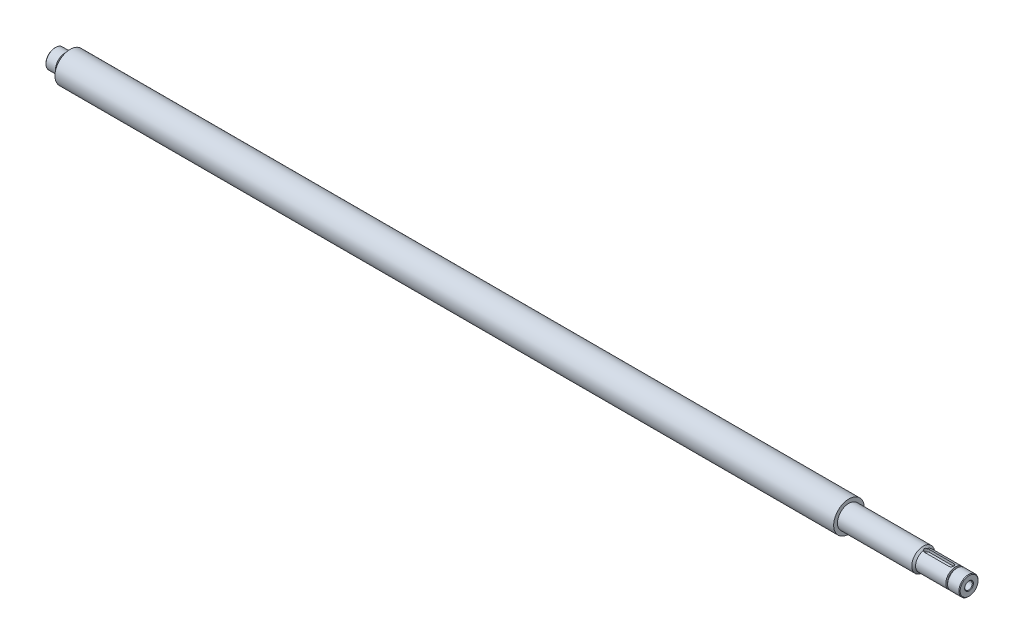
ISO-10303-21;
HEADER;
FILE_DESCRIPTION(('STEP AP214'),'2;1');
FILE_NAME('part.step','',(''),(''),'','','');
FILE_SCHEMA(('AUTOMOTIVE_DESIGN { 1 0 10303 214 1 1 1 1 }'));
ENDSEC;
DATA;
#1=APPLICATION_CONTEXT('core data for automotive mechanical design processes');
#2=APPLICATION_PROTOCOL_DEFINITION('international standard','automotive_design',2000,#1);
#3=PRODUCT_CONTEXT('',#1,'mechanical');
#4=PRODUCT('Part','Part','',(#3));
#5=PRODUCT_RELATED_PRODUCT_CATEGORY('part','',(#4));
#6=PRODUCT_DEFINITION_FORMATION('','',#4);
#7=PRODUCT_DEFINITION_CONTEXT('part definition',#1,'design');
#8=PRODUCT_DEFINITION('design','',#6,#7);
#9=PRODUCT_DEFINITION_SHAPE('','',#8);
#10=(LENGTH_UNIT() NAMED_UNIT(*) SI_UNIT(.MILLI.,.METRE.));
#11=(NAMED_UNIT(*) PLANE_ANGLE_UNIT() SI_UNIT($,.RADIAN.));
#12=(NAMED_UNIT(*) SI_UNIT($,.STERADIAN.) SOLID_ANGLE_UNIT());
#13=UNCERTAINTY_MEASURE_WITH_UNIT(LENGTH_MEASURE(1.E-05),#10,'distance_accuracy_value','');
#14=(GEOMETRIC_REPRESENTATION_CONTEXT(3) GLOBAL_UNCERTAINTY_ASSIGNED_CONTEXT((#13)) GLOBAL_UNIT_ASSIGNED_CONTEXT((#10,
#11,#12)) REPRESENTATION_CONTEXT('',''));
#15=CARTESIAN_POINT('',(0.,0.,0.));
#16=DIRECTION('',(0.,0.,1.));
#17=DIRECTION('',(1.,0.,0.));
#18=AXIS2_PLACEMENT_3D('',#15,#16,#17);
#19=CARTESIAN_POINT('',(364.29314999998,0.,0.));
#20=DIRECTION('',(1.,0.,0.));
#21=DIRECTION('',(0.,0.,-1.));
#22=AXIS2_PLACEMENT_3D('',#19,#20,#21);
#23=PLANE('',#22);
#24=CARTESIAN_POINT('',(364.29314999998,0.,0.));
#25=DIRECTION('',(1.,0.,0.));
#26=DIRECTION('',(0.,0.,-1.));
#27=AXIS2_PLACEMENT_3D('',#24,#25,#26);
#28=CIRCLE('',#27,1.5875);
#29=CARTESIAN_POINT('',(364.29314999998,0.,-1.5875));
#30=VERTEX_POINT('',#29);
#31=EDGE_CURVE('E20',#30,#30,#28,.T.);
#32=ORIENTED_EDGE('',*,*,#31,.T.);
#33=EDGE_LOOP('',(#32));
#34=FACE_BOUND('',#33,.T.);
#35=ADVANCED_FACE('F17',(#34),#23,.T.);
#36=CARTESIAN_POINT('',(364.29314999998,0.,0.));
#37=DIRECTION('',(1.,0.,0.));
#38=DIRECTION('',(0.,0.,-1.));
#39=AXIS2_PLACEMENT_3D('',#36,#37,#38);
#40=CYLINDRICAL_SURFACE('',#39,1.5875);
#41=ORIENTED_EDGE('',*,*,#31,.F.);
#42=EDGE_LOOP('',(#41));
#43=FACE_BOUND('',#42,.T.);
#44=CARTESIAN_POINT('',(383.089149999989,0.,0.));
#45=DIRECTION('',(1.,0.,0.));
#46=DIRECTION('',(0.,0.,-1.));
#47=AXIS2_PLACEMENT_3D('',#44,#45,#46);
#48=CIRCLE('',#47,1.58750000002783);
#49=CARTESIAN_POINT('',(383.089149999989,0.,-1.58750000002783));
#50=VERTEX_POINT('',#49);
#51=EDGE_CURVE('E109',#50,#50,#48,.T.);
#52=ORIENTED_EDGE('',*,*,#51,.T.);
#53=EDGE_LOOP('',(#52));
#54=FACE_BOUND('',#53,.T.);
#55=ADVANCED_FACE('F197',(#43,#54),#40,.F.);
#56=CARTESIAN_POINT('',(383.343149999916,0.,0.));
#57=DIRECTION('',(1.,0.,0.));
#58=DIRECTION('',(0.,1.,0.));
#59=AXIS2_PLACEMENT_3D('',#56,#57,#58);
#60=CONICAL_SURFACE('',#59,1.84149999989813,0.785398163397448);
#61=ORIENTED_EDGE('',*,*,#51,.F.);
#62=EDGE_LOOP('',(#61));
#63=FACE_BOUND('',#62,.T.);
#64=CARTESIAN_POINT('',(383.343149999973,0.,0.));
#65=DIRECTION('',(1.,0.,0.));
#66=DIRECTION('',(0.,1.,0.));
#67=AXIS2_PLACEMENT_3D('',#64,#65,#66);
#68=CIRCLE('',#67,1.84149999995498);
#69=CARTESIAN_POINT('',(383.343149999973,1.84149999995498,0.));
#70=VERTEX_POINT('',#69);
#71=EDGE_CURVE('E111',#70,#70,#68,.F.);
#72=ORIENTED_EDGE('',*,*,#71,.F.);
#73=EDGE_LOOP('',(#72));
#74=FACE_BOUND('',#73,.T.);
#75=ADVANCED_FACE('F194',(#63,#74),#60,.F.);
#76=CARTESIAN_POINT('',(383.34314999998,0.,0.));
#77=DIRECTION('',(1.,0.,0.));
#78=DIRECTION('',(0.,0.,-1.));
#79=AXIS2_PLACEMENT_3D('',#76,#77,#78);
#80=PLANE('',#79);
#81=CARTESIAN_POINT('',(383.343149999973,0.,0.));
#82=DIRECTION('',(-1.,0.,0.));
#83=DIRECTION('',(0.,0.,1.));
#84=AXIS2_PLACEMENT_3D('',#81,#82,#83);
#85=CIRCLE('',#84,3.71474999991506);
#86=CARTESIAN_POINT('',(383.343149999973,0.,3.71474999991506));
#87=VERTEX_POINT('',#86);
#88=EDGE_CURVE('E108',#87,#87,#85,.T.);
#89=ORIENTED_EDGE('',*,*,#88,.F.);
#90=EDGE_LOOP('',(#89));
#91=FACE_BOUND('',#90,.T.);
#92=ORIENTED_EDGE('',*,*,#71,.T.);
#93=EDGE_LOOP('',(#92));
#94=FACE_BOUND('',#93,.T.);
#95=ADVANCED_FACE('F190',(#91,#94),#80,.T.);
#96=CARTESIAN_POINT('',(383.089149999989,0.,0.));
#97=DIRECTION('',(-1.,0.,0.));
#98=DIRECTION('',(0.,0.,1.));
#99=AXIS2_PLACEMENT_3D('',#96,#97,#98);
#100=CONICAL_SURFACE('',#99,3.96874999989905,0.785398163397448);
#101=ORIENTED_EDGE('',*,*,#88,.T.);
#102=EDGE_LOOP('',(#101));
#103=FACE_BOUND('',#102,.T.);
#104=CARTESIAN_POINT('',(383.08914999998,0.,0.));
#105=DIRECTION('',(-1.,0.,0.));
#106=DIRECTION('',(0.,0.,1.));
#107=AXIS2_PLACEMENT_3D('',#104,#105,#106);
#108=CIRCLE('',#107,3.96875);
#109=CARTESIAN_POINT('',(383.08914999998,0.,3.96875));
#110=VERTEX_POINT('',#109);
#111=EDGE_CURVE('E104',#110,#110,#108,.T.);
#112=ORIENTED_EDGE('',*,*,#111,.F.);
#113=EDGE_LOOP('',(#112));
#114=FACE_BOUND('',#113,.T.);
#115=ADVANCED_FACE('F186',(#103,#114),#100,.T.);
#116=CARTESIAN_POINT('',(3.175,0.,0.));
#117=DIRECTION('',(-1.,0.,0.));
#118=DIRECTION('',(0.,0.,1.));
#119=AXIS2_PLACEMENT_3D('',#116,#117,#118);
#120=PLANE('',#119);
#121=CARTESIAN_POINT('',(3.17500000005566,0.,0.));
#122=DIRECTION('',(1.,0.,0.));
#123=DIRECTION('',(0.,0.,-1.));
#124=AXIS2_PLACEMENT_3D('',#121,#122,#123);
#125=CIRCLE('',#124,3.7147499999719);
#126=CARTESIAN_POINT('',(3.17500000005566,0.,-3.7147499999719));
#127=VERTEX_POINT('',#126);
#128=EDGE_CURVE('E107',#127,#127,#125,.T.);
#129=ORIENTED_EDGE('',*,*,#128,.F.);
#130=EDGE_LOOP('',(#129));
#131=FACE_BOUND('',#130,.T.);
#132=ADVANCED_FACE('F182',(#131),#120,.T.);
#133=CARTESIAN_POINT('',(383.34314999998,0.,0.));
#134=DIRECTION('',(-1.,0.,0.));
#135=DIRECTION('',(0.,0.,1.));
#136=AXIS2_PLACEMENT_3D('',#133,#134,#135);
#137=CYLINDRICAL_SURFACE('',#136,3.96875);
#138=ORIENTED_EDGE('',*,*,#111,.T.);
#139=EDGE_LOOP('',(#138));
#140=FACE_BOUND('',#139,.T.);
#141=CARTESIAN_POINT('',(378.36474999998,0.,0.));
#142=DIRECTION('',(-1.,0.,0.));
#143=DIRECTION('',(0.,0.,1.));
#144=AXIS2_PLACEMENT_3D('',#141,#142,#143);
#145=CIRCLE('',#144,3.96875);
#146=CARTESIAN_POINT('',(378.36474999998,0.,3.96875));
#147=VERTEX_POINT('',#146);
#148=EDGE_CURVE('E78',#147,#147,#145,.T.);
#149=ORIENTED_EDGE('',*,*,#148,.F.);
#150=EDGE_LOOP('',(#149));
#151=FACE_BOUND('',#150,.T.);
#152=ADVANCED_FACE('F178',(#140,#151),#137,.T.);
#153=CARTESIAN_POINT('',(3.42899999992596,0.,0.));
#154=DIRECTION('',(1.,0.,0.));
#155=DIRECTION('',(0.,0.,-1.));
#156=AXIS2_PLACEMENT_3D('',#153,#154,#155);
#157=CONICAL_SURFACE('',#156,3.96874999989905,0.785398163509345);
#158=ORIENTED_EDGE('',*,*,#128,.T.);
#159=EDGE_LOOP('',(#158));
#160=FACE_BOUND('',#159,.T.);
#161=CARTESIAN_POINT('',(3.42900000000003,0.,0.));
#162=DIRECTION('',(1.,0.,0.));
#163=DIRECTION('',(0.,0.,-1.));
#164=AXIS2_PLACEMENT_3D('',#161,#162,#163);
#165=CIRCLE('',#164,3.96875);
#166=CARTESIAN_POINT('',(3.42900000000003,0.,-3.96875));
#167=VERTEX_POINT('',#166);
#168=EDGE_CURVE('E100',#167,#167,#165,.T.);
#169=ORIENTED_EDGE('',*,*,#168,.F.);
#170=EDGE_LOOP('',(#169));
#171=FACE_BOUND('',#170,.T.);
#172=ADVANCED_FACE('F174',(#160,#171),#157,.T.);
#173=CARTESIAN_POINT('',(378.36474999998,0.,-22.225));
#174=DIRECTION('',(-1.,0.,0.));
#175=DIRECTION('',(0.,0.,1.));
#176=AXIS2_PLACEMENT_3D('',#173,#174,#175);
#177=PLANE('',#176);
#178=ORIENTED_EDGE('',*,*,#148,.T.);
#179=EDGE_LOOP('',(#178));
#180=FACE_BOUND('',#179,.T.);
#181=CARTESIAN_POINT('',(378.36474999998,0.,0.));
#182=DIRECTION('',(1.,0.,0.));
#183=DIRECTION('',(0.,0.,-1.));
#184=AXIS2_PLACEMENT_3D('',#181,#182,#183);
#185=CIRCLE('',#184,3.175);
#186=CARTESIAN_POINT('',(378.36474999998,0.,-3.175));
#187=VERTEX_POINT('',#186);
#188=EDGE_CURVE('E103',#187,#187,#185,.F.);
#189=ORIENTED_EDGE('',*,*,#188,.F.);
#190=EDGE_LOOP('',(#189));
#191=FACE_BOUND('',#190,.T.);
#192=ADVANCED_FACE('F168',(#180,#191),#177,.T.);
#193=CARTESIAN_POINT('',(365.81714999998,5.30554999999999,0.));
#194=DIRECTION('',(0.,-1.,0.));
#195=DIRECTION('',(0.,0.,-1.));
#196=AXIS2_PLACEMENT_3D('',#193,#194,#195);
#197=CYLINDRICAL_SURFACE('',#196,1.016);
#198=CARTESIAN_POINT('',(365.81714999998,3.83649847680146,1.01600000000003));
#199=CARTESIAN_POINT('',(365.789074339526,3.83649655807795,1.01600024098621));
#200=CARTESIAN_POINT('',(365.7610128192,3.83680706636788,1.01483546195629));
#201=CARTESIAN_POINT('',(365.705099410303,3.83803295663375,1.01019216098555));
#202=CARTESIAN_POINT('',(365.677247490381,3.83894824625515,1.00671399231573));
#203=CARTESIAN_POINT('',(365.594402662799,3.84256546981599,0.992856299490583));
#204=CARTESIAN_POINT('',(365.539979413233,3.84613895420594,0.979053401170294));
#205=CARTESIAN_POINT('',(365.434316289364,3.85519131533632,0.942773419508419));
#206=CARTESIAN_POINT('',(365.383076692287,3.86067035773495,0.920295581999039));
#207=CARTESIAN_POINT('',(365.285096296162,3.87291119616642,0.867334861884763));
#208=CARTESIAN_POINT('',(365.238352927547,3.87967225289173,0.836856589068619));
#209=CARTESIAN_POINT('',(365.169226267174,3.89074557233872,0.783245948925418));
#210=CARTESIAN_POINT('',(365.14492969341,3.89487805845011,0.76249275990274));
#211=CARTESIAN_POINT('',(365.09843710947,3.9031715311668,0.718833958468433));
#212=CARTESIAN_POINT('',(365.076237660529,3.9073324586808,0.695931996926632));
#213=CARTESIAN_POINT('',(365.055149999974,3.91144021589343,0.672020833004098));
#214=B_SPLINE_CURVE_WITH_KNOTS('',3,(#198,#199,#200,#201,#202,#203,#204,#205,#206,#207,#208,
#209,#210,#211,#212,#213),.UNSPECIFIED.,.F.,.F.,(4,2,2,2,2,2,2,4),(0.,0.084173300717206,
0.168333750525152,0.336236358766278,0.50415356714138,0.67197423449429,0.768506844657109,
0.864878312959558),.UNSPECIFIED.);
#215=CARTESIAN_POINT('',(365.81714999998,3.83649847680146,1.01600000000003));
#216=VERTEX_POINT('',#215);
#217=CARTESIAN_POINT('',(365.055149999982,3.91144021584078,0.672020833012472));
#218=VERTEX_POINT('',#217);
#219=EDGE_CURVE('E96',#216,#218,#214,.T.);
#220=ORIENTED_EDGE('',*,*,#219,.F.);
#221=DIRECTION('',(0.,-1.,0.));
#222=VECTOR('',#221,1.);
#223=CARTESIAN_POINT('',(365.81714999998,5.30554999999999,1.01600000000003));
#224=LINE('',#223,#222);
#225=CARTESIAN_POINT('',(365.81714999998,2.81634999999999,1.01600000000003));
#226=VERTEX_POINT('',#225);
#227=EDGE_CURVE('E94',#226,#216,#224,.F.);
#228=ORIENTED_EDGE('',*,*,#227,.F.);
#229=CARTESIAN_POINT('',(365.81714999998,2.81634999999999,0.));
#230=DIRECTION('',(0.,-1.,0.));
#231=DIRECTION('',(0.,0.,-1.));
#232=AXIS2_PLACEMENT_3D('',#229,#230,#231);
#233=CIRCLE('',#232,1.016);
#234=CARTESIAN_POINT('',(365.81714999998,2.81634999999999,-1.01599999999997));
#235=VERTEX_POINT('',#234);
#236=EDGE_CURVE('E92',#226,#235,#233,.T.);
#237=ORIENTED_EDGE('',*,*,#236,.T.);
#238=DIRECTION('',(0.,-1.,0.));
#239=VECTOR('',#238,1.);
#240=CARTESIAN_POINT('',(365.81714999998,5.30554999999999,-1.01599999999997));
#241=LINE('',#240,#239);
#242=CARTESIAN_POINT('',(365.81714999998,3.83649847680148,-1.01599999999997));
#243=VERTEX_POINT('',#242);
#244=EDGE_CURVE('E77',#243,#235,#241,.T.);
#245=ORIENTED_EDGE('',*,*,#244,.F.);
#246=CARTESIAN_POINT('',(365.05514999998,3.91144021589234,-0.672020833010454));
#247=CARTESIAN_POINT('',(365.092863201918,3.90408226838989,-0.714842817990914));
#248=CARTESIAN_POINT('',(365.134224918746,3.89655779756544,-0.754419427857203));
#249=CARTESIAN_POINT('',(365.223086497352,3.88197562196348,-0.826189348854452));
#250=CARTESIAN_POINT('',(365.270594355154,3.87491854366297,-0.858372887617566));
#251=CARTESIAN_POINT('',(365.37054734497,3.86208640953377,-0.914382203674269));
#252=CARTESIAN_POINT('',(365.422998681667,3.85631299621681,-0.938197295479835));
#253=CARTESIAN_POINT('',(365.531257868991,3.8467604993438,-0.976630360325471));
#254=CARTESIAN_POINT('',(365.587058548847,3.84297731334557,-0.991267264360344));
#255=CARTESIAN_POINT('',(365.672317957102,3.83912394272326,-1.00604532812612));
#256=CARTESIAN_POINT('',(365.701156173613,3.83814278398676,-1.0097754687014));
#257=CARTESIAN_POINT('',(365.75904132168,3.8368291335745,-1.01475220932442));
#258=CARTESIAN_POINT('',(365.78808810149,3.83649621045302,-1.01600046125276));
#259=CARTESIAN_POINT('',(365.81714999998,3.83649847680148,-1.01599999999997));
#260=B_SPLINE_CURVE_WITH_KNOTS('',3,(#246,#247,#248,#249,#250,#251,#252,#253,#254,#255,#256,
#257,#258,#259),.UNSPECIFIED.,.F.,.F.,(4,2,2,2,2,2,4),(0.,0.17240455398,0.345035702357616,
0.517886485481197,0.690379562391287,0.777564930764776,0.86469225137165),.UNSPECIFIED.);
#261=CARTESIAN_POINT('',(365.055149999968,3.91144021578482,-0.672020832996854));
#262=VERTEX_POINT('',#261);
#263=EDGE_CURVE('E67',#262,#243,#260,.T.);
#264=ORIENTED_EDGE('',*,*,#263,.F.);
#265=CARTESIAN_POINT('',(365.055149999937,3.91144021579326,0.672020832961947));
#266=CARTESIAN_POINT('',(365.026045649241,3.94663707757243,0.638985000088227));
#267=CARTESIAN_POINT('',(364.99813445496,3.98057362417654,0.603031915369367));
#268=CARTESIAN_POINT('',(364.945782346284,4.04446808087447,0.52463353926634));
#269=CARTESIAN_POINT('',(364.921387328837,4.07437308912116,0.482115200203082));
#270=CARTESIAN_POINT('',(364.88324642174,4.12126181441779,0.401911695213403));
#271=CARTESIAN_POINT('',(364.868355806798,4.13961619956198,0.365594566361844));
#272=CARTESIAN_POINT('',(364.842514459879,4.17151821849332,0.289723753061901));
#273=CARTESIAN_POINT('',(364.831548734036,4.18508414235761,0.25018310998333));
#274=CARTESIAN_POINT('',(364.814258213123,4.20649305464903,0.168050687431386));
#275=CARTESIAN_POINT('',(364.807988168618,4.21426852199973,0.125429079943492));
#276=CARTESIAN_POINT('',(364.800977206253,4.22296361722546,0.0390204895654291));
#277=CARTESIAN_POINT('',(364.800234806667,4.22388508236565,-0.00476617786333961));
#278=CARTESIAN_POINT('',(364.804035806214,4.21917025653282,-0.0849404597698114));
#279=CARTESIAN_POINT('',(364.807784476603,4.21451992539556,-0.121431098087903));
#280=CARTESIAN_POINT('',(364.818977695527,4.20064865423194,-0.192918818065849));
#281=CARTESIAN_POINT('',(364.826421938455,4.19142809214245,-0.227916022965843));
#282=CARTESIAN_POINT('',(364.847034893171,4.16593408534218,-0.305201192198014));
#283=CARTESIAN_POINT('',(364.861220946354,4.14841101056433,-0.346801535770036));
#284=CARTESIAN_POINT('',(364.893725643349,4.10836577713652,-0.425891694219275));
#285=CARTESIAN_POINT('',(364.912060244422,4.08582432097091,-0.463364783610832));
#286=CARTESIAN_POINT('',(364.950316407108,4.03894291029061,-0.53128121744061));
#287=CARTESIAN_POINT('',(364.97001172542,4.01486952292547,-0.562042296543696));
#288=CARTESIAN_POINT('',(365.011284433417,3.96459674581604,-0.619737119716292));
#289=CARTESIAN_POINT('',(365.032841403113,3.9384205992902,-0.646705536926426));
#290=CARTESIAN_POINT('',(365.055149999947,3.9114402157815,-0.672020832972935));
#291=B_SPLINE_CURVE_WITH_KNOTS('',3,(#265,#266,#267,#268,#269,#270,#271,#272,#273,#274,#275,
#276,#277,#278,#279,#280,#281,#282,#283,#284,#285,#286,#287,#288,#289,#290),.UNSPECIFIED.,.F.,
.F.,(4,2,2,2,2,2,2,2,2,2,2,2,4),(0.,0.169491291431036,0.34102606970601,0.470534814534422,
0.59954339215234,0.730033713382287,0.860489054471362,0.970897544435752,1.08129690565363,
1.22247535003477,1.364206353615,1.49517443421655,1.62485417002255),.UNSPECIFIED.);
#292=EDGE_CURVE('E61',#218,#262,#291,.T.);
#293=ORIENTED_EDGE('',*,*,#292,.F.);
#294=EDGE_LOOP('',(#220,#228,#237,#245,#264,#293));
#295=FACE_BOUND('',#294,.T.);
#296=ADVANCED_FACE('F90',(#295),#197,.F.);
#297=CARTESIAN_POINT('',(3.175,0.,0.));
#298=DIRECTION('',(1.,0.,0.));
#299=DIRECTION('',(0.,0.,-1.));
#300=AXIS2_PLACEMENT_3D('',#297,#298,#299);
#301=CYLINDRICAL_SURFACE('',#300,3.96875);
#302=ORIENTED_EDGE('',*,*,#168,.T.);
#303=EDGE_LOOP('',(#302));
#304=FACE_BOUND('',#303,.T.);
#305=CARTESIAN_POINT('',(7.39140000000003,0.,0.));
#306=DIRECTION('',(1.,0.,0.));
#307=DIRECTION('',(0.,0.,-1.));
#308=AXIS2_PLACEMENT_3D('',#305,#306,#307);
#309=CIRCLE('',#308,3.96875);
#310=CARTESIAN_POINT('',(7.39140000000003,0.,-3.96875));
#311=VERTEX_POINT('',#310);
#312=EDGE_CURVE('E259',#311,#311,#309,.T.);
#313=ORIENTED_EDGE('',*,*,#312,.F.);
#314=EDGE_LOOP('',(#313));
#315=FACE_BOUND('',#314,.T.);
#316=ADVANCED_FACE('F167',(#304,#315),#301,.T.);
#317=CARTESIAN_POINT('',(364.2614,0.,0.));
#318=DIRECTION('',(1.,0.,0.));
#319=DIRECTION('',(0.,0.,-1.));
#320=AXIS2_PLACEMENT_3D('',#317,#318,#319);
#321=CYLINDRICAL_SURFACE('',#320,3.175);
#322=CARTESIAN_POINT('',(377.62814999998,0.,0.));
#323=DIRECTION('',(1.,0.,0.));
#324=DIRECTION('',(0.,0.,-1.));
#325=AXIS2_PLACEMENT_3D('',#322,#323,#324);
#326=CIRCLE('',#325,3.175);
#327=CARTESIAN_POINT('',(377.62814999998,0.,-3.175));
#328=VERTEX_POINT('',#327);
#329=EDGE_CURVE('E255',#328,#328,#326,.F.);
#330=ORIENTED_EDGE('',*,*,#329,.F.);
#331=EDGE_LOOP('',(#330));
#332=FACE_BOUND('',#331,.T.);
#333=ORIENTED_EDGE('',*,*,#188,.T.);
#334=EDGE_LOOP('',(#333));
#335=FACE_BOUND('',#334,.T.);
#336=ADVANCED_FACE('F269',(#332,#335),#321,.T.);
#337=CARTESIAN_POINT('',(365.81714999998,2.81634999999999,0.));
#338=DIRECTION('',(0.,-1.,0.));
#339=DIRECTION('',(0.,0.,-1.));
#340=AXIS2_PLACEMENT_3D('',#337,#338,#339);
#341=PLANE('',#340);
#342=DIRECTION('',(1.,0.,0.));
#343=VECTOR('',#342,1.);
#344=CARTESIAN_POINT('',(365.81714999998,2.81634999999999,1.01600000000003));
#345=LINE('',#344,#343);
#346=CARTESIAN_POINT('',(375.97714999998,2.81634999999999,1.01600000000003));
#347=VERTEX_POINT('',#346);
#348=EDGE_CURVE('E251',#226,#347,#345,.T.);
#349=ORIENTED_EDGE('',*,*,#348,.T.);
#350=CARTESIAN_POINT('',(375.97714999998,2.81634999999999,0.));
#351=DIRECTION('',(0.,-1.,0.));
#352=DIRECTION('',(0.,0.,-1.));
#353=AXIS2_PLACEMENT_3D('',#350,#351,#352);
#354=CIRCLE('',#353,1.016);
#355=CARTESIAN_POINT('',(375.97714999998,2.81634999999999,-1.01599999999997));
#356=VERTEX_POINT('',#355);
#357=EDGE_CURVE('E253',#347,#356,#354,.F.);
#358=ORIENTED_EDGE('',*,*,#357,.T.);
#359=DIRECTION('',(-1.,0.,0.));
#360=VECTOR('',#359,1.);
#361=CARTESIAN_POINT('',(365.81714999998,2.81634999999999,-1.01599999999997));
#362=LINE('',#361,#360);
#363=EDGE_CURVE('E254',#356,#235,#362,.T.);
#364=ORIENTED_EDGE('',*,*,#363,.T.);
#365=ORIENTED_EDGE('',*,*,#236,.F.);
#366=EDGE_LOOP('',(#349,#358,#364,#365));
#367=FACE_BOUND('',#366,.T.);
#368=ADVANCED_FACE('F272',(#367),#341,.F.);
#369=CARTESIAN_POINT('',(7.39140000000003,0.,-22.225));
#370=DIRECTION('',(1.,0.,0.));
#371=DIRECTION('',(0.,0.,-1.));
#372=AXIS2_PLACEMENT_3D('',#369,#370,#371);
#373=PLANE('',#372);
#374=ORIENTED_EDGE('',*,*,#312,.T.);
#375=EDGE_LOOP('',(#374));
#376=FACE_BOUND('',#375,.T.);
#377=CARTESIAN_POINT('',(7.39140000000005,0.,0.));
#378=DIRECTION('',(1.,0.,0.));
#379=DIRECTION('',(0.,0.,-1.));
#380=AXIS2_PLACEMENT_3D('',#377,#378,#379);
#381=CIRCLE('',#380,3.17500000000005);
#382=CARTESIAN_POINT('',(7.39140000000005,0.,-3.17500000000005));
#383=VERTEX_POINT('',#382);
#384=EDGE_CURVE('E250',#383,#383,#381,.T.);
#385=ORIENTED_EDGE('',*,*,#384,.F.);
#386=EDGE_LOOP('',(#385));
#387=FACE_BOUND('',#386,.T.);
#388=ADVANCED_FACE('F278',(#376,#387),#373,.T.);
#389=CARTESIAN_POINT('',(377.62814999998,0.,-22.225));
#390=DIRECTION('',(1.,0.,0.));
#391=DIRECTION('',(0.,0.,-1.));
#392=AXIS2_PLACEMENT_3D('',#389,#390,#391);
#393=PLANE('',#392);
#394=CARTESIAN_POINT('',(377.62814999998,0.,0.));
#395=DIRECTION('',(-1.,0.,0.));
#396=DIRECTION('',(0.,0.,1.));
#397=AXIS2_PLACEMENT_3D('',#394,#395,#396);
#398=CIRCLE('',#397,3.96875);
#399=CARTESIAN_POINT('',(377.62814999998,0.,3.96875));
#400=VERTEX_POINT('',#399);
#401=EDGE_CURVE('E87',#400,#400,#398,.T.);
#402=ORIENTED_EDGE('',*,*,#401,.F.);
#403=EDGE_LOOP('',(#402));
#404=FACE_BOUND('',#403,.T.);
#405=ORIENTED_EDGE('',*,*,#329,.T.);
#406=EDGE_LOOP('',(#405));
#407=FACE_BOUND('',#406,.T.);
#408=ADVANCED_FACE('F284',(#404,#407),#393,.T.);
#409=CARTESIAN_POINT('',(365.81714999998,5.30554999999999,-1.01599999999997));
#410=DIRECTION('',(0.,0.,-1.));
#411=DIRECTION('',(-1.,0.,0.));
#412=AXIS2_PLACEMENT_3D('',#409,#410,#411);
#413=PLANE('',#412);
#414=ORIENTED_EDGE('',*,*,#363,.F.);
#415=DIRECTION('',(0.,-1.,0.));
#416=VECTOR('',#415,1.);
#417=CARTESIAN_POINT('',(375.97714999998,5.30554999999999,-1.01599999999997));
#418=LINE('',#417,#416);
#419=CARTESIAN_POINT('',(375.97714999998,3.83649847680148,-1.01599999999997));
#420=VERTEX_POINT('',#419);
#421=EDGE_CURVE('E85',#356,#420,#418,.F.);
#422=ORIENTED_EDGE('',*,*,#421,.T.);
#423=DIRECTION('',(-1.,0.,0.));
#424=VECTOR('',#423,1.);
#425=CARTESIAN_POINT('',(383.34314999998,3.83649847680148,-1.01599999999998));
#426=LINE('',#425,#424);
#427=EDGE_CURVE('E73',#243,#420,#426,.F.);
#428=ORIENTED_EDGE('',*,*,#427,.F.);
#429=ORIENTED_EDGE('',*,*,#244,.T.);
#430=EDGE_LOOP('',(#414,#422,#428,#429));
#431=FACE_BOUND('',#430,.T.);
#432=ADVANCED_FACE('F82',(#431),#413,.F.);
#433=CARTESIAN_POINT('',(375.97714999998,5.30554999999999,0.));
#434=DIRECTION('',(0.,-1.,0.));
#435=DIRECTION('',(0.,0.,-1.));
#436=AXIS2_PLACEMENT_3D('',#433,#434,#435);
#437=CYLINDRICAL_SURFACE('',#436,1.016);
#438=ORIENTED_EDGE('',*,*,#357,.F.);
#439=DIRECTION('',(0.,1.,0.));
#440=VECTOR('',#439,1.);
#441=CARTESIAN_POINT('',(375.97714999998,5.30554999999999,1.01600000000003));
#442=LINE('',#441,#440);
#443=CARTESIAN_POINT('',(375.97714999998,3.83649847680146,1.01600000000003));
#444=VERTEX_POINT('',#443);
#445=EDGE_CURVE('E35',#347,#444,#442,.T.);
#446=ORIENTED_EDGE('',*,*,#445,.T.);
#447=CARTESIAN_POINT('',(375.97714999998,3.83649847680148,-1.01599999999997));
#448=CARTESIAN_POINT('',(376.005232117698,3.8364965307861,-1.01600036882975));
#449=CARTESIAN_POINT('',(376.03330029599,3.83680719885179,-1.0148349780035));
#450=CARTESIAN_POINT('',(376.089226268173,3.83803367436216,-1.01018942257077));
#451=CARTESIAN_POINT('',(376.117084097897,3.83894937627158,-1.00670966165613));
#452=CARTESIAN_POINT('',(376.199921518973,3.8425670200339,-0.992850358077406));
#453=CARTESIAN_POINT('',(376.254331119969,3.84613973249548,-0.979050564349116));
#454=CARTESIAN_POINT('',(376.359962146837,3.85518959202628,-0.942780043809727));
#455=CARTESIAN_POINT('',(376.411183960423,3.86066650696061,-0.920310373877343));
#456=CARTESIAN_POINT('',(376.509157970993,3.87290441870489,-0.867366047154576));
#457=CARTESIAN_POINT('',(376.555908865854,3.87966578790086,-0.836889067919602));
#458=CARTESIAN_POINT('',(376.644660726039,3.89388354188958,-0.76805250279463));
#459=CARTESIAN_POINT('',(376.686543604242,3.90135139962633,-0.729543072267722));
#460=CARTESIAN_POINT('',(376.763335608172,3.91604199140291,-0.646053823404773));
#461=CARTESIAN_POINT('',(376.798243613297,3.92326468589965,-0.601072967345447));
#462=CARTESIAN_POINT('',(376.860580248618,3.93677879775893,-0.50510200654503));
#463=CARTESIAN_POINT('',(376.88789163842,3.94305499816506,-0.454033423400695));
#464=CARTESIAN_POINT('',(376.933495722822,3.95383663506577,-0.347844862832095));
#465=CARTESIAN_POINT('',(376.951790252562,3.95834243184069,-0.292725712418508));
#466=CARTESIAN_POINT('',(376.978461233202,3.96499439613665,-0.181237611453934));
#467=CARTESIAN_POINT('',(376.987039572087,3.9671885264225,-0.124919869410297));
#468=CARTESIAN_POINT('',(376.994668963786,3.96913729991417,-0.0116034940671553));
#469=CARTESIAN_POINT('',(376.99372128116,3.96889226691424,0.0453950478541406));
#470=CARTESIAN_POINT('',(376.982469291487,3.96602573182547,0.157050518952893));
#471=CARTESIAN_POINT('',(376.972383179651,3.9634596510183,0.211731074693986));
#472=CARTESIAN_POINT('',(376.943492100012,3.95630422351476,0.318595637923097));
#473=CARTESIAN_POINT('',(376.9246867361,3.95171478489952,0.37077953187116));
#474=CARTESIAN_POINT('',(376.878717503722,3.94094438262645,0.471739184881145));
#475=CARTESIAN_POINT('',(376.851476902399,3.93474889714661,0.520478392673244));
#476=CARTESIAN_POINT('',(376.789469375868,3.92143706805957,0.612768417256418));
#477=CARTESIAN_POINT('',(376.754701251652,3.91432057782425,0.656318405775385));
#478=CARTESIAN_POINT('',(376.677464717508,3.89970329674694,0.738292158129691));
#479=CARTESIAN_POINT('',(376.634806538737,3.89219732876389,0.776536373111752));
#480=CARTESIAN_POINT('',(376.543591617661,3.87782831789178,0.845378453000194));
#481=CARTESIAN_POINT('',(376.495033261568,3.87096545181421,0.875974218910324));
#482=CARTESIAN_POINT('',(376.393023080127,3.8586388773889,0.928775964053226));
#483=CARTESIAN_POINT('',(376.339544393242,3.8531835536007,0.950932025157885));
#484=CARTESIAN_POINT('',(376.229478708631,3.84439831971569,0.985853852591684));
#485=CARTESIAN_POINT('',(376.17289650192,3.84106522846847,0.998633677961683));
#486=CARTESIAN_POINT('',(376.092708062573,3.83816902624918,1.00967440468688));
#487=CARTESIAN_POINT('',(376.069645740232,3.8375435800947,1.01204684611684));
#488=CARTESIAN_POINT('',(376.023442626753,3.83670846641588,1.01520789726257));
#489=CARTESIAN_POINT('',(376.000302021728,3.83649813111499,1.01599905077559));
#490=CARTESIAN_POINT('',(375.97714999998,3.83649847680146,1.01600000000003));
#491=B_SPLINE_CURVE_WITH_KNOTS('',3,(#447,#448,#449,#450,#451,#452,#453,#454,#455,#456,#457,
#458,#459,#460,#461,#462,#463,#464,#465,#466,#467,#468,#469,#470,#471,#472,#473,#474,#475,#476,
#477,#478,#479,#480,#481,#482,#483,#484,#485,#486,#487,#488,#489,#490),.UNSPECIFIED.,.F.,.F.,(4,
2,2,2,2,2,2,2,2,2,2,2,2,2,2,2,2,2,2,2,2,4),(0.,0.0841930560916811,0.16837143037474,
0.336236459648141,0.504081032233321,0.671974340399637,0.843336289917674,1.01472574881463,
1.18862960092247,1.36249804493094,1.53268338742047,1.7028461384339,1.8690500457987,
2.03526150439915,2.20303170807668,2.37082865446001,2.54336536457755,2.71594937282154,
2.88953887011914,3.06286754658296,3.13239841206051,3.20181733382417),.UNSPECIFIED.);
#492=EDGE_CURVE('E86',#420,#444,#491,.T.);
#493=ORIENTED_EDGE('',*,*,#492,.F.);
#494=ORIENTED_EDGE('',*,*,#421,.F.);
#495=EDGE_LOOP('',(#438,#446,#493,#494));
#496=FACE_BOUND('',#495,.T.);
#497=ADVANCED_FACE('F136',(#496),#437,.F.);
#498=CARTESIAN_POINT('',(365.81714999998,5.30554999999999,1.01600000000003));
#499=DIRECTION('',(0.,0.,1.));
#500=DIRECTION('',(1.,0.,0.));
#501=AXIS2_PLACEMENT_3D('',#498,#499,#500);
#502=PLANE('',#501);
#503=ORIENTED_EDGE('',*,*,#348,.F.);
#504=ORIENTED_EDGE('',*,*,#227,.T.);
#505=DIRECTION('',(-1.,0.,0.));
#506=VECTOR('',#505,1.);
#507=CARTESIAN_POINT('',(383.34314999998,3.83649847680146,1.01600000000002));
#508=LINE('',#507,#506);
#509=EDGE_CURVE('E128',#444,#216,#508,.T.);
#510=ORIENTED_EDGE('',*,*,#509,.F.);
#511=ORIENTED_EDGE('',*,*,#445,.F.);
#512=EDGE_LOOP('',(#503,#504,#510,#511));
#513=FACE_BOUND('',#512,.T.);
#514=ADVANCED_FACE('F292',(#513),#502,.F.);
#515=CARTESIAN_POINT('',(364.2614,0.,0.));
#516=DIRECTION('',(1.,0.,0.));
#517=DIRECTION('',(0.,0.,-1.));
#518=AXIS2_PLACEMENT_3D('',#515,#516,#517);
#519=CYLINDRICAL_SURFACE('',#518,3.17500000000005);
#520=ORIENTED_EDGE('',*,*,#384,.T.);
#521=EDGE_LOOP('',(#520));
#522=FACE_BOUND('',#521,.T.);
#523=CARTESIAN_POINT('',(8.12800000000002,0.,0.));
#524=DIRECTION('',(1.,0.,0.));
#525=DIRECTION('',(0.,0.,-1.));
#526=AXIS2_PLACEMENT_3D('',#523,#524,#525);
#527=CIRCLE('',#526,3.17500000000005);
#528=CARTESIAN_POINT('',(8.12800000000002,0.,-3.17500000000005));
#529=VERTEX_POINT('',#528);
#530=EDGE_CURVE('E125',#529,#529,#527,.T.);
#531=ORIENTED_EDGE('',*,*,#530,.F.);
#532=EDGE_LOOP('',(#531));
#533=FACE_BOUND('',#532,.T.);
#534=ADVANCED_FACE('F145',(#522,#533),#519,.T.);
#535=CARTESIAN_POINT('',(383.34314999998,0.,0.));
#536=DIRECTION('',(-1.,0.,0.));
#537=DIRECTION('',(0.,0.,1.));
#538=AXIS2_PLACEMENT_3D('',#535,#536,#537);
#539=CYLINDRICAL_SURFACE('',#538,3.96875);
#540=ORIENTED_EDGE('',*,*,#219,.T.);
#541=CARTESIAN_POINT('',(365.055149999989,0.,0.));
#542=DIRECTION('',(-1.,0.,0.));
#543=DIRECTION('',(0.,0.,-1.));
#544=AXIS2_PLACEMENT_3D('',#541,#542,#543);
#545=CIRCLE('',#544,3.96874999989905);
#546=EDGE_CURVE('E74',#262,#218,#545,.T.);
#547=ORIENTED_EDGE('',*,*,#546,.F.);
#548=ORIENTED_EDGE('',*,*,#263,.T.);
#549=ORIENTED_EDGE('',*,*,#427,.T.);
#550=ORIENTED_EDGE('',*,*,#492,.T.);
#551=ORIENTED_EDGE('',*,*,#509,.T.);
#552=EDGE_LOOP('',(#540,#547,#548,#549,#550,#551));
#553=FACE_BOUND('',#552,.T.);
#554=ORIENTED_EDGE('',*,*,#401,.T.);
#555=EDGE_LOOP('',(#554));
#556=FACE_BOUND('',#555,.T.);
#557=ADVANCED_FACE('F70',(#553,#556),#539,.T.);
#558=CARTESIAN_POINT('',(8.128,0.,-22.225));
#559=DIRECTION('',(-1.,0.,0.));
#560=DIRECTION('',(0.,0.,1.));
#561=AXIS2_PLACEMENT_3D('',#558,#559,#560);
#562=PLANE('',#561);
#563=CARTESIAN_POINT('',(8.128,0.,0.));
#564=DIRECTION('',(1.,0.,0.));
#565=DIRECTION('',(0.,0.,-1.));
#566=AXIS2_PLACEMENT_3D('',#563,#564,#565);
#567=CIRCLE('',#566,3.96875);
#568=CARTESIAN_POINT('',(8.128,0.,-3.96875));
#569=VERTEX_POINT('',#568);
#570=EDGE_CURVE('E122',#569,#569,#567,.T.);
#571=ORIENTED_EDGE('',*,*,#570,.F.);
#572=EDGE_LOOP('',(#571));
#573=FACE_BOUND('',#572,.T.);
#574=ORIENTED_EDGE('',*,*,#530,.T.);
#575=EDGE_LOOP('',(#574));
#576=FACE_BOUND('',#575,.T.);
#577=ADVANCED_FACE('F144',(#573,#576),#562,.T.);
#578=CARTESIAN_POINT('',(364.261400000032,0.,0.));
#579=DIRECTION('',(-1.,0.,0.));
#580=DIRECTION('',(0.,0.,1.));
#581=AXIS2_PLACEMENT_3D('',#578,#579,#580);
#582=CONICAL_SURFACE('',#581,4.76249999985612,0.785398163433255);
#583=ORIENTED_EDGE('',*,*,#546,.T.);
#584=ORIENTED_EDGE('',*,*,#292,.T.);
#585=EDGE_LOOP('',(#583,#584));
#586=FACE_BOUND('',#585,.T.);
#587=CARTESIAN_POINT('',(364.2614,0.,0.));
#588=DIRECTION('',(-1.,0.,0.));
#589=DIRECTION('',(0.,0.,1.));
#590=AXIS2_PLACEMENT_3D('',#587,#588,#589);
#591=CIRCLE('',#590,4.7625);
#592=CARTESIAN_POINT('',(364.2614,0.,4.7625));
#593=VERTEX_POINT('',#592);
#594=EDGE_CURVE('E121',#593,#593,#591,.T.);
#595=ORIENTED_EDGE('',*,*,#594,.F.);
#596=EDGE_LOOP('',(#595));
#597=FACE_BOUND('',#596,.T.);
#598=ADVANCED_FACE('F230',(#586,#597),#582,.T.);
#599=CARTESIAN_POINT('',(3.175,0.,0.));
#600=DIRECTION('',(1.,0.,0.));
#601=DIRECTION('',(0.,0.,-1.));
#602=AXIS2_PLACEMENT_3D('',#599,#600,#601);
#603=CYLINDRICAL_SURFACE('',#602,3.96875);
#604=CARTESIAN_POINT('',(9.525,0.,0.));
#605=DIRECTION('',(1.,0.,0.));
#606=DIRECTION('',(0.,0.,-1.));
#607=AXIS2_PLACEMENT_3D('',#604,#605,#606);
#608=CIRCLE('',#607,3.96875);
#609=CARTESIAN_POINT('',(9.525,0.,-3.96875));
#610=VERTEX_POINT('',#609);
#611=EDGE_CURVE('E118',#610,#610,#608,.T.);
#612=ORIENTED_EDGE('',*,*,#611,.F.);
#613=EDGE_LOOP('',(#612));
#614=FACE_BOUND('',#613,.T.);
#615=ORIENTED_EDGE('',*,*,#570,.T.);
#616=EDGE_LOOP('',(#615));
#617=FACE_BOUND('',#616,.T.);
#618=ADVANCED_FACE('F227',(#614,#617),#603,.T.);
#619=CARTESIAN_POINT('',(364.2614,0.,0.));
#620=DIRECTION('',(-1.,0.,0.));
#621=DIRECTION('',(0.,0.,1.));
#622=AXIS2_PLACEMENT_3D('',#619,#620,#621);
#623=CYLINDRICAL_SURFACE('',#622,4.7625);
#624=CARTESIAN_POINT('',(333.375,0.,0.));
#625=DIRECTION('',(-1.,0.,0.));
#626=DIRECTION('',(0.,0.,1.));
#627=AXIS2_PLACEMENT_3D('',#624,#625,#626);
#628=CIRCLE('',#627,4.7625);
#629=CARTESIAN_POINT('',(333.375,0.,4.7625));
#630=VERTEX_POINT('',#629);
#631=EDGE_CURVE('E115',#630,#630,#628,.T.);
#632=ORIENTED_EDGE('',*,*,#631,.F.);
#633=EDGE_LOOP('',(#632));
#634=FACE_BOUND('',#633,.T.);
#635=ORIENTED_EDGE('',*,*,#594,.T.);
#636=EDGE_LOOP('',(#635));
#637=FACE_BOUND('',#636,.T.);
#638=ADVANCED_FACE('F223',(#634,#637),#623,.T.);
#639=CARTESIAN_POINT('',(9.525,6.35000000000002,0.));
#640=DIRECTION('',(-1.,0.,0.));
#641=DIRECTION('',(0.,0.,1.));
#642=AXIS2_PLACEMENT_3D('',#639,#640,#641);
#643=PLANE('',#642);
#644=ORIENTED_EDGE('',*,*,#611,.T.);
#645=EDGE_LOOP('',(#644));
#646=FACE_BOUND('',#645,.T.);
#647=CARTESIAN_POINT('',(9.52500000000001,0.,0.));
#648=DIRECTION('',(1.,0.,0.));
#649=DIRECTION('',(0.,0.,-1.));
#650=AXIS2_PLACEMENT_3D('',#647,#648,#649);
#651=CIRCLE('',#650,6.35000000000002);
#652=CARTESIAN_POINT('',(9.52500000000001,0.,-6.35000000000002));
#653=VERTEX_POINT('',#652);
#654=EDGE_CURVE('E26',#653,#653,#651,.T.);
#655=ORIENTED_EDGE('',*,*,#654,.F.);
#656=EDGE_LOOP('',(#655));
#657=FACE_BOUND('',#656,.T.);
#658=ADVANCED_FACE('F216',(#646,#657),#643,.T.);
#659=CARTESIAN_POINT('',(333.375,0.,0.));
#660=DIRECTION('',(1.,0.,0.));
#661=DIRECTION('',(0.,0.,-1.));
#662=AXIS2_PLACEMENT_3D('',#659,#660,#661);
#663=PLANE('',#662);
#664=ORIENTED_EDGE('',*,*,#631,.T.);
#665=EDGE_LOOP('',(#664));
#666=FACE_BOUND('',#665,.T.);
#667=CARTESIAN_POINT('',(333.375,0.,0.));
#668=DIRECTION('',(1.,0.,0.));
#669=DIRECTION('',(0.,0.,-1.));
#670=AXIS2_PLACEMENT_3D('',#667,#668,#669);
#671=CIRCLE('',#670,6.35000000000002);
#672=CARTESIAN_POINT('',(333.375,0.,-6.35000000000002));
#673=VERTEX_POINT('',#672);
#674=EDGE_CURVE('E11',#673,#673,#671,.F.);
#675=ORIENTED_EDGE('',*,*,#674,.F.);
#676=EDGE_LOOP('',(#675));
#677=FACE_BOUND('',#676,.T.);
#678=ADVANCED_FACE('F210',(#666,#677),#663,.T.);
#679=CARTESIAN_POINT('',(9.525,0.,0.));
#680=DIRECTION('',(1.,0.,0.));
#681=DIRECTION('',(0.,0.,-1.));
#682=AXIS2_PLACEMENT_3D('',#679,#680,#681);
#683=CYLINDRICAL_SURFACE('',#682,6.35000000000002);
#684=ORIENTED_EDGE('',*,*,#654,.T.);
#685=EDGE_LOOP('',(#684));
#686=FACE_BOUND('',#685,.T.);
#687=ORIENTED_EDGE('',*,*,#674,.T.);
#688=EDGE_LOOP('',(#687));
#689=FACE_BOUND('',#688,.T.);
#690=ADVANCED_FACE('F208',(#686,#689),#683,.T.);
#691=CLOSED_SHELL('',(#35,#55,#75,#95,#115,#132,#152,#172,#192,#296,#316,#336,#368,#388,#408,
#432,#497,#514,#534,#557,#577,#598,#618,#638,#658,#678,#690));
#692=MANIFOLD_SOLID_BREP('B1',#691);
#693=ADVANCED_BREP_SHAPE_REPRESENTATION('',(#18,#692),#14);
#694=SHAPE_DEFINITION_REPRESENTATION(#9,#693);
ENDSEC;
END-ISO-10303-21;
